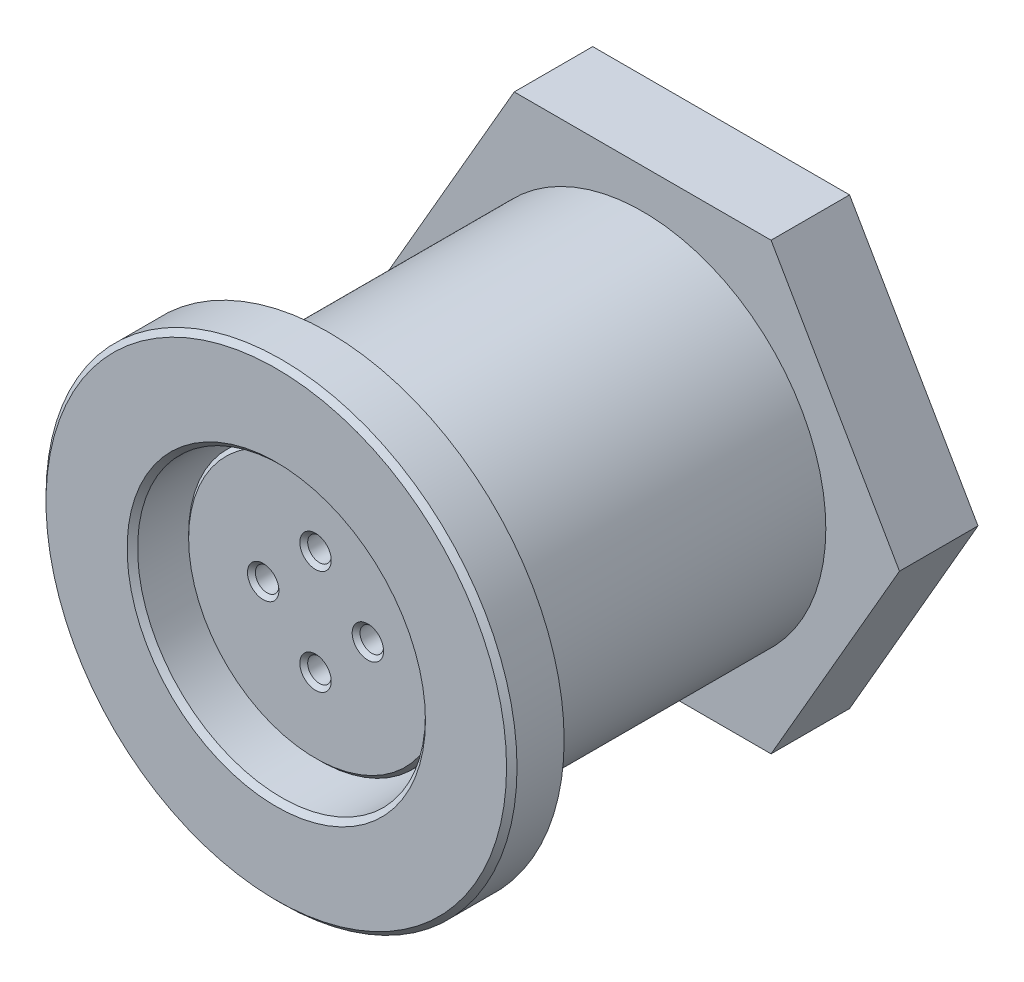
ISO-10303-21;
HEADER;
FILE_DESCRIPTION(('STEP AP214'),'2;1');
FILE_NAME('part.step','',(''),(''),'','','');
FILE_SCHEMA(('AUTOMOTIVE_DESIGN { 1 0 10303 214 1 1 1 1 }'));
ENDSEC;
DATA;
#1=APPLICATION_CONTEXT('core data for automotive mechanical design processes');
#2=APPLICATION_PROTOCOL_DEFINITION('international standard','automotive_design',2000,#1);
#3=PRODUCT_CONTEXT('',#1,'mechanical');
#4=PRODUCT('Part','Part','',(#3));
#5=PRODUCT_RELATED_PRODUCT_CATEGORY('part','',(#4));
#6=PRODUCT_DEFINITION_FORMATION('','',#4);
#7=PRODUCT_DEFINITION_CONTEXT('part definition',#1,'design');
#8=PRODUCT_DEFINITION('design','',#6,#7);
#9=PRODUCT_DEFINITION_SHAPE('','',#8);
#10=(LENGTH_UNIT() NAMED_UNIT(*) SI_UNIT(.MILLI.,.METRE.));
#11=(NAMED_UNIT(*) PLANE_ANGLE_UNIT() SI_UNIT($,.RADIAN.));
#12=(NAMED_UNIT(*) SI_UNIT($,.STERADIAN.) SOLID_ANGLE_UNIT());
#13=UNCERTAINTY_MEASURE_WITH_UNIT(LENGTH_MEASURE(1.E-05),#10,'distance_accuracy_value','');
#14=(GEOMETRIC_REPRESENTATION_CONTEXT(3) GLOBAL_UNCERTAINTY_ASSIGNED_CONTEXT((#13)) GLOBAL_UNIT_ASSIGNED_CONTEXT((#10,
#11,#12)) REPRESENTATION_CONTEXT('',''));
#15=CARTESIAN_POINT('',(0.,0.,0.));
#16=DIRECTION('',(0.,0.,1.));
#17=DIRECTION('',(1.,0.,0.));
#18=AXIS2_PLACEMENT_3D('',#15,#16,#17);
#19=CARTESIAN_POINT('',(0.,0.,-8.));
#20=DIRECTION('',(0.,0.,1.));
#21=DIRECTION('',(1.,0.,0.));
#22=AXIS2_PLACEMENT_3D('',#19,#20,#21);
#23=PLANE('',#22);
#24=CARTESIAN_POINT('',(0.,0.,-8.));
#25=DIRECTION('',(0.,0.,1.));
#26=DIRECTION('',(1.,0.,0.));
#27=AXIS2_PLACEMENT_3D('',#24,#25,#26);
#28=CIRCLE('',#27,5.5);
#29=CARTESIAN_POINT('',(5.5,0.,-8.));
#30=VERTEX_POINT('',#29);
#31=EDGE_CURVE('E169',#30,#30,#28,.T.);
#32=ORIENTED_EDGE('',*,*,#31,.T.);
#33=EDGE_LOOP('',(#32));
#34=FACE_BOUND('',#33,.T.);
#35=CARTESIAN_POINT('',(0.,0.,-8.));
#36=DIRECTION('',(0.,0.,1.));
#37=DIRECTION('',(1.,0.,0.));
#38=AXIS2_PLACEMENT_3D('',#35,#36,#37);
#39=CIRCLE('',#38,5.);
#40=CARTESIAN_POINT('',(5.,0.,-8.));
#41=VERTEX_POINT('',#40);
#42=EDGE_CURVE('E157',#41,#41,#39,.T.);
#43=ORIENTED_EDGE('',*,*,#42,.F.);
#44=EDGE_LOOP('',(#43));
#45=FACE_BOUND('',#44,.T.);
#46=ADVANCED_FACE('F32',(#34,#45),#23,.T.);
#47=CARTESIAN_POINT('',(0.,0.,0.));
#48=DIRECTION('',(0.,0.,1.));
#49=DIRECTION('',(1.,0.,0.));
#50=AXIS2_PLACEMENT_3D('',#47,#48,#49);
#51=PLANE('',#50);
#52=CARTESIAN_POINT('',(0.,0.,0.));
#53=DIRECTION('',(0.,0.,-1.));
#54=DIRECTION('',(-1.,0.,0.));
#55=AXIS2_PLACEMENT_3D('',#52,#53,#54);
#56=CIRCLE('',#55,8.25);
#57=CARTESIAN_POINT('',(-8.25,0.,0.));
#58=VERTEX_POINT('',#57);
#59=EDGE_CURVE('E163',#58,#58,#56,.T.);
#60=ORIENTED_EDGE('',*,*,#59,.F.);
#61=EDGE_LOOP('',(#60));
#62=FACE_BOUND('',#61,.T.);
#63=CARTESIAN_POINT('',(0.,0.,0.));
#64=DIRECTION('',(0.,0.,1.));
#65=DIRECTION('',(1.,0.,0.));
#66=AXIS2_PLACEMENT_3D('',#63,#64,#65);
#67=CIRCLE('',#66,9.);
#68=CARTESIAN_POINT('',(9.,0.,0.));
#69=VERTEX_POINT('',#68);
#70=EDGE_CURVE('E172',#69,#69,#67,.T.);
#71=ORIENTED_EDGE('',*,*,#70,.F.);
#72=EDGE_LOOP('',(#71));
#73=FACE_BOUND('',#72,.T.);
#74=ADVANCED_FACE('F250',(#62,#73),#51,.F.);
#75=CARTESIAN_POINT('',(0.,0.,2.));
#76=DIRECTION('',(0.,0.,-1.));
#77=DIRECTION('',(-1.,0.,0.));
#78=AXIS2_PLACEMENT_3D('',#75,#76,#77);
#79=CYLINDRICAL_SURFACE('',#78,9.);
#80=CARTESIAN_POINT('',(0.,0.,1.80000000000001));
#81=DIRECTION('',(0.,0.,1.));
#82=DIRECTION('',(1.,0.,0.));
#83=AXIS2_PLACEMENT_3D('',#80,#81,#82);
#84=CIRCLE('',#83,9.);
#85=CARTESIAN_POINT('',(9.,0.,1.80000000000001));
#86=VERTEX_POINT('',#85);
#87=EDGE_CURVE('E214',#86,#86,#84,.F.);
#88=ORIENTED_EDGE('',*,*,#87,.T.);
#89=EDGE_LOOP('',(#88));
#90=FACE_BOUND('',#89,.T.);
#91=ORIENTED_EDGE('',*,*,#70,.T.);
#92=EDGE_LOOP('',(#91));
#93=FACE_BOUND('',#92,.T.);
#94=ADVANCED_FACE('F34',(#90,#93),#79,.T.);
#95=CARTESIAN_POINT('',(0.,0.,2.));
#96=DIRECTION('',(0.,0.,1.));
#97=DIRECTION('',(1.,0.,0.));
#98=AXIS2_PLACEMENT_3D('',#95,#96,#97);
#99=PLANE('',#98);
#100=CARTESIAN_POINT('',(0.,0.,2.));
#101=DIRECTION('',(0.,0.,1.));
#102=DIRECTION('',(1.,0.,0.));
#103=AXIS2_PLACEMENT_3D('',#100,#101,#102);
#104=CIRCLE('',#103,5.7);
#105=CARTESIAN_POINT('',(5.7,0.,2.));
#106=VERTEX_POINT('',#105);
#107=EDGE_CURVE('E211',#106,#106,#104,.F.);
#108=ORIENTED_EDGE('',*,*,#107,.T.);
#109=EDGE_LOOP('',(#108));
#110=FACE_BOUND('',#109,.T.);
#111=CARTESIAN_POINT('',(0.,0.,2.));
#112=DIRECTION('',(0.,0.,1.));
#113=DIRECTION('',(1.,0.,0.));
#114=AXIS2_PLACEMENT_3D('',#111,#112,#113);
#115=CIRCLE('',#114,8.80000000000001);
#116=CARTESIAN_POINT('',(8.80000000000001,0.,2.));
#117=VERTEX_POINT('',#116);
#118=EDGE_CURVE('E208',#117,#117,#115,.T.);
#119=ORIENTED_EDGE('',*,*,#118,.T.);
#120=EDGE_LOOP('',(#119));
#121=FACE_BOUND('',#120,.T.);
#122=ADVANCED_FACE('F265',(#110,#121),#99,.T.);
#123=CARTESIAN_POINT('',(0.,0.,-8.));
#124=DIRECTION('',(0.,0.,1.));
#125=DIRECTION('',(1.,0.,0.));
#126=AXIS2_PLACEMENT_3D('',#123,#124,#125);
#127=CYLINDRICAL_SURFACE('',#126,5.5);
#128=CARTESIAN_POINT('',(0.,0.,1.8));
#129=DIRECTION('',(0.,0.,1.));
#130=DIRECTION('',(1.,0.,0.));
#131=AXIS2_PLACEMENT_3D('',#128,#129,#130);
#132=CIRCLE('',#131,5.5);
#133=CARTESIAN_POINT('',(5.5,0.,1.8));
#134=VERTEX_POINT('',#133);
#135=EDGE_CURVE('E205',#134,#134,#132,.T.);
#136=ORIENTED_EDGE('',*,*,#135,.T.);
#137=EDGE_LOOP('',(#136));
#138=FACE_BOUND('',#137,.T.);
#139=ORIENTED_EDGE('',*,*,#31,.F.);
#140=EDGE_LOOP('',(#139));
#141=FACE_BOUND('',#140,.T.);
#142=ADVANCED_FACE('F263',(#138,#141),#127,.F.);
#143=CARTESIAN_POINT('',(0.,0.,1.));
#144=DIRECTION('',(0.,0.,-1.));
#145=DIRECTION('',(-1.,0.,0.));
#146=AXIS2_PLACEMENT_3D('',#143,#144,#145);
#147=CYLINDRICAL_SURFACE('',#146,8.25);
#148=CARTESIAN_POINT('',(0.,0.,1.));
#149=DIRECTION('',(0.,0.,-1.));
#150=DIRECTION('',(-1.,0.,0.));
#151=AXIS2_PLACEMENT_3D('',#148,#149,#150);
#152=CIRCLE('',#151,8.25);
#153=CARTESIAN_POINT('',(-8.25,0.,1.));
#154=VERTEX_POINT('',#153);
#155=EDGE_CURVE('E166',#154,#154,#152,.T.);
#156=ORIENTED_EDGE('',*,*,#155,.F.);
#157=EDGE_LOOP('',(#156));
#158=FACE_BOUND('',#157,.T.);
#159=ORIENTED_EDGE('',*,*,#59,.T.);
#160=EDGE_LOOP('',(#159));
#161=FACE_BOUND('',#160,.T.);
#162=ADVANCED_FACE('F261',(#158,#161),#147,.F.);
#163=CARTESIAN_POINT('',(0.,0.,1.));
#164=DIRECTION('',(0.,0.,-1.));
#165=DIRECTION('',(-1.,0.,0.));
#166=AXIS2_PLACEMENT_3D('',#163,#164,#165);
#167=PLANE('',#166);
#168=CARTESIAN_POINT('',(0.,0.,1.));
#169=DIRECTION('',(0.,0.,-1.));
#170=DIRECTION('',(-1.,0.,0.));
#171=AXIS2_PLACEMENT_3D('',#168,#169,#170);
#172=CIRCLE('',#171,7.);
#173=CARTESIAN_POINT('',(-7.,0.,1.));
#174=VERTEX_POINT('',#173);
#175=EDGE_CURVE('E160',#174,#174,#172,.T.);
#176=ORIENTED_EDGE('',*,*,#175,.F.);
#177=EDGE_LOOP('',(#176));
#178=FACE_BOUND('',#177,.T.);
#179=ORIENTED_EDGE('',*,*,#155,.T.);
#180=EDGE_LOOP('',(#179));
#181=FACE_BOUND('',#180,.T.);
#182=ADVANCED_FACE('F271',(#178,#181),#167,.T.);
#183=CARTESIAN_POINT('',(0.,0.,-16.));
#184=DIRECTION('',(0.,0.,1.));
#185=DIRECTION('',(1.,0.,0.));
#186=AXIS2_PLACEMENT_3D('',#183,#184,#185);
#187=CYLINDRICAL_SURFACE('',#186,7.);
#188=CARTESIAN_POINT('',(0.,0.,-12.));
#189=DIRECTION('',(0.,0.,1.));
#190=DIRECTION('',(1.,0.,0.));
#191=AXIS2_PLACEMENT_3D('',#188,#189,#190);
#192=CIRCLE('',#191,7.);
#193=CARTESIAN_POINT('',(7.,0.,-12.));
#194=VERTEX_POINT('',#193);
#195=EDGE_CURVE('E36',#194,#194,#192,.T.);
#196=ORIENTED_EDGE('',*,*,#195,.T.);
#197=EDGE_LOOP('',(#196));
#198=FACE_BOUND('',#197,.T.);
#199=ORIENTED_EDGE('',*,*,#175,.T.);
#200=EDGE_LOOP('',(#199));
#201=FACE_BOUND('',#200,.T.);
#202=ADVANCED_FACE('F268',(#198,#201),#187,.T.);
#203=CARTESIAN_POINT('',(0.,0.,0.5));
#204=DIRECTION('',(0.,0.,-1.));
#205=DIRECTION('',(-1.,0.,0.));
#206=AXIS2_PLACEMENT_3D('',#203,#204,#205);
#207=CYLINDRICAL_SURFACE('',#206,5.);
#208=CARTESIAN_POINT('',(0.,0.,0.349999999999999));
#209=DIRECTION('',(0.,0.,1.));
#210=DIRECTION('',(1.,0.,0.));
#211=AXIS2_PLACEMENT_3D('',#208,#209,#210);
#212=CIRCLE('',#211,5.);
#213=CARTESIAN_POINT('',(5.,0.,0.349999999999999));
#214=VERTEX_POINT('',#213);
#215=EDGE_CURVE('E196',#214,#214,#212,.F.);
#216=ORIENTED_EDGE('',*,*,#215,.T.);
#217=EDGE_LOOP('',(#216));
#218=FACE_BOUND('',#217,.T.);
#219=ORIENTED_EDGE('',*,*,#42,.T.);
#220=EDGE_LOOP('',(#219));
#221=FACE_BOUND('',#220,.T.);
#222=ADVANCED_FACE('F270',(#218,#221),#207,.T.);
#223=CARTESIAN_POINT('',(0.,0.,0.5));
#224=DIRECTION('',(0.,0.,1.));
#225=DIRECTION('',(1.,0.,0.));
#226=AXIS2_PLACEMENT_3D('',#223,#224,#225);
#227=PLANE('',#226);
#228=CARTESIAN_POINT('',(2.,0.,0.5));
#229=DIRECTION('',(0.,0.,1.));
#230=DIRECTION('',(1.,0.,0.));
#231=AXIS2_PLACEMENT_3D('',#228,#229,#230);
#232=CIRCLE('',#231,0.599999999999996);
#233=CARTESIAN_POINT('',(2.6,0.,0.5));
#234=VERTEX_POINT('',#233);
#235=EDGE_CURVE('E190',#234,#234,#232,.F.);
#236=ORIENTED_EDGE('',*,*,#235,.T.);
#237=EDGE_LOOP('',(#236));
#238=FACE_BOUND('',#237,.T.);
#239=CARTESIAN_POINT('',(-2.,0.,0.5));
#240=DIRECTION('',(0.,0.,1.));
#241=DIRECTION('',(1.,0.,0.));
#242=AXIS2_PLACEMENT_3D('',#239,#240,#241);
#243=CIRCLE('',#242,0.599999999999996);
#244=CARTESIAN_POINT('',(-1.4,0.,0.5));
#245=VERTEX_POINT('',#244);
#246=EDGE_CURVE('E187',#245,#245,#243,.F.);
#247=ORIENTED_EDGE('',*,*,#246,.T.);
#248=EDGE_LOOP('',(#247));
#249=FACE_BOUND('',#248,.T.);
#250=CARTESIAN_POINT('',(0.,0.,0.5));
#251=DIRECTION('',(0.,0.,1.));
#252=DIRECTION('',(1.,0.,0.));
#253=AXIS2_PLACEMENT_3D('',#250,#251,#252);
#254=CIRCLE('',#253,4.85);
#255=CARTESIAN_POINT('',(4.85,0.,0.5));
#256=VERTEX_POINT('',#255);
#257=EDGE_CURVE('E184',#256,#256,#254,.T.);
#258=ORIENTED_EDGE('',*,*,#257,.T.);
#259=EDGE_LOOP('',(#258));
#260=FACE_BOUND('',#259,.T.);
#261=CARTESIAN_POINT('',(0.,-2.,0.5));
#262=DIRECTION('',(0.,0.,1.));
#263=DIRECTION('',(1.,0.,0.));
#264=AXIS2_PLACEMENT_3D('',#261,#262,#263);
#265=CIRCLE('',#264,0.599999999999996);
#266=CARTESIAN_POINT('',(0.599999999999996,-2.,0.5));
#267=VERTEX_POINT('',#266);
#268=EDGE_CURVE('E181',#267,#267,#265,.F.);
#269=ORIENTED_EDGE('',*,*,#268,.T.);
#270=EDGE_LOOP('',(#269));
#271=FACE_BOUND('',#270,.T.);
#272=CARTESIAN_POINT('',(0.,2.,0.5));
#273=DIRECTION('',(0.,0.,1.));
#274=DIRECTION('',(1.,0.,0.));
#275=AXIS2_PLACEMENT_3D('',#272,#273,#274);
#276=CIRCLE('',#275,0.599999999999996);
#277=CARTESIAN_POINT('',(0.599999999999996,2.,0.5));
#278=VERTEX_POINT('',#277);
#279=EDGE_CURVE('E178',#278,#278,#276,.F.);
#280=ORIENTED_EDGE('',*,*,#279,.T.);
#281=EDGE_LOOP('',(#280));
#282=FACE_BOUND('',#281,.T.);
#283=ADVANCED_FACE('F349',(#238,#249,#260,#271,#282),#227,.T.);
#284=CARTESIAN_POINT('',(0.,2.,-6.5));
#285=DIRECTION('',(0.,0.,1.));
#286=DIRECTION('',(1.,0.,0.));
#287=AXIS2_PLACEMENT_3D('',#284,#285,#286);
#288=CYLINDRICAL_SURFACE('',#287,0.45);
#289=CARTESIAN_POINT('',(0.,2.,0.350000000000006));
#290=DIRECTION('',(0.,0.,1.));
#291=DIRECTION('',(1.,0.,0.));
#292=AXIS2_PLACEMENT_3D('',#289,#290,#291);
#293=CIRCLE('',#292,0.45);
#294=CARTESIAN_POINT('',(0.45,2.,0.350000000000006));
#295=VERTEX_POINT('',#294);
#296=EDGE_CURVE('E202',#295,#295,#293,.T.);
#297=ORIENTED_EDGE('',*,*,#296,.T.);
#298=EDGE_LOOP('',(#297));
#299=FACE_BOUND('',#298,.T.);
#300=CARTESIAN_POINT('',(0.,2.,-6.5));
#301=DIRECTION('',(0.,0.,1.));
#302=DIRECTION('',(1.,0.,0.));
#303=AXIS2_PLACEMENT_3D('',#300,#301,#302);
#304=CIRCLE('',#303,0.45);
#305=CARTESIAN_POINT('',(0.45,2.,-6.5));
#306=VERTEX_POINT('',#305);
#307=EDGE_CURVE('E154',#306,#306,#304,.T.);
#308=ORIENTED_EDGE('',*,*,#307,.F.);
#309=EDGE_LOOP('',(#308));
#310=FACE_BOUND('',#309,.T.);
#311=ADVANCED_FACE('F345',(#299,#310),#288,.F.);
#312=CARTESIAN_POINT('',(0.,2.,-6.5));
#313=DIRECTION('',(0.,0.,1.));
#314=DIRECTION('',(1.,0.,0.));
#315=AXIS2_PLACEMENT_3D('',#312,#313,#314);
#316=PLANE('',#315);
#317=ORIENTED_EDGE('',*,*,#307,.T.);
#318=EDGE_LOOP('',(#317));
#319=FACE_BOUND('',#318,.T.);
#320=ADVANCED_FACE('F341',(#319),#316,.T.);
#321=CARTESIAN_POINT('',(0.,-2.,-6.5));
#322=DIRECTION('',(0.,0.,1.));
#323=DIRECTION('',(1.,0.,0.));
#324=AXIS2_PLACEMENT_3D('',#321,#322,#323);
#325=CYLINDRICAL_SURFACE('',#324,0.45);
#326=CARTESIAN_POINT('',(0.,-2.,0.350000000000006));
#327=DIRECTION('',(0.,0.,1.));
#328=DIRECTION('',(1.,0.,0.));
#329=AXIS2_PLACEMENT_3D('',#326,#327,#328);
#330=CIRCLE('',#329,0.45);
#331=CARTESIAN_POINT('',(0.45,-2.,0.350000000000006));
#332=VERTEX_POINT('',#331);
#333=EDGE_CURVE('E199',#332,#332,#330,.T.);
#334=ORIENTED_EDGE('',*,*,#333,.T.);
#335=EDGE_LOOP('',(#334));
#336=FACE_BOUND('',#335,.T.);
#337=CARTESIAN_POINT('',(0.,-2.,-6.5));
#338=DIRECTION('',(0.,0.,1.));
#339=DIRECTION('',(1.,0.,0.));
#340=AXIS2_PLACEMENT_3D('',#337,#338,#339);
#341=CIRCLE('',#340,0.45);
#342=CARTESIAN_POINT('',(0.45,-2.,-6.5));
#343=VERTEX_POINT('',#342);
#344=EDGE_CURVE('E151',#343,#343,#341,.T.);
#345=ORIENTED_EDGE('',*,*,#344,.F.);
#346=EDGE_LOOP('',(#345));
#347=FACE_BOUND('',#346,.T.);
#348=ADVANCED_FACE('F337',(#336,#347),#325,.F.);
#349=CARTESIAN_POINT('',(0.,-2.,-6.5));
#350=DIRECTION('',(0.,0.,1.));
#351=DIRECTION('',(1.,0.,0.));
#352=AXIS2_PLACEMENT_3D('',#349,#350,#351);
#353=PLANE('',#352);
#354=ORIENTED_EDGE('',*,*,#344,.T.);
#355=EDGE_LOOP('',(#354));
#356=FACE_BOUND('',#355,.T.);
#357=ADVANCED_FACE('F333',(#356),#353,.T.);
#358=CARTESIAN_POINT('',(2.,0.,-6.5));
#359=DIRECTION('',(0.,0.,1.));
#360=DIRECTION('',(1.,0.,0.));
#361=AXIS2_PLACEMENT_3D('',#358,#359,#360);
#362=CYLINDRICAL_SURFACE('',#361,0.45);
#363=CARTESIAN_POINT('',(2.,0.,0.350000000000006));
#364=DIRECTION('',(0.,0.,1.));
#365=DIRECTION('',(1.,0.,0.));
#366=AXIS2_PLACEMENT_3D('',#363,#364,#365);
#367=CIRCLE('',#366,0.45);
#368=CARTESIAN_POINT('',(2.45,0.,0.350000000000006));
#369=VERTEX_POINT('',#368);
#370=EDGE_CURVE('E175',#369,#369,#367,.T.);
#371=ORIENTED_EDGE('',*,*,#370,.T.);
#372=EDGE_LOOP('',(#371));
#373=FACE_BOUND('',#372,.T.);
#374=CARTESIAN_POINT('',(2.,0.,-6.5));
#375=DIRECTION('',(0.,0.,1.));
#376=DIRECTION('',(1.,0.,0.));
#377=AXIS2_PLACEMENT_3D('',#374,#375,#376);
#378=CIRCLE('',#377,0.45);
#379=CARTESIAN_POINT('',(2.45,0.,-6.5));
#380=VERTEX_POINT('',#379);
#381=EDGE_CURVE('E148',#380,#380,#378,.T.);
#382=ORIENTED_EDGE('',*,*,#381,.F.);
#383=EDGE_LOOP('',(#382));
#384=FACE_BOUND('',#383,.T.);
#385=ADVANCED_FACE('F329',(#373,#384),#362,.F.);
#386=CARTESIAN_POINT('',(2.,0.,-6.5));
#387=DIRECTION('',(0.,0.,1.));
#388=DIRECTION('',(1.,0.,0.));
#389=AXIS2_PLACEMENT_3D('',#386,#387,#388);
#390=PLANE('',#389);
#391=ORIENTED_EDGE('',*,*,#381,.T.);
#392=EDGE_LOOP('',(#391));
#393=FACE_BOUND('',#392,.T.);
#394=ADVANCED_FACE('F325',(#393),#390,.T.);
#395=CARTESIAN_POINT('',(-2.,0.,-6.5));
#396=DIRECTION('',(0.,0.,1.));
#397=DIRECTION('',(1.,0.,0.));
#398=AXIS2_PLACEMENT_3D('',#395,#396,#397);
#399=CYLINDRICAL_SURFACE('',#398,0.45);
#400=CARTESIAN_POINT('',(-2.,0.,0.350000000000006));
#401=DIRECTION('',(0.,0.,1.));
#402=DIRECTION('',(1.,0.,0.));
#403=AXIS2_PLACEMENT_3D('',#400,#401,#402);
#404=CIRCLE('',#403,0.45);
#405=CARTESIAN_POINT('',(-1.55,0.,0.350000000000006));
#406=VERTEX_POINT('',#405);
#407=EDGE_CURVE('E193',#406,#406,#404,.T.);
#408=ORIENTED_EDGE('',*,*,#407,.T.);
#409=EDGE_LOOP('',(#408));
#410=FACE_BOUND('',#409,.T.);
#411=CARTESIAN_POINT('',(-2.,0.,-6.5));
#412=DIRECTION('',(0.,0.,1.));
#413=DIRECTION('',(1.,0.,0.));
#414=AXIS2_PLACEMENT_3D('',#411,#412,#413);
#415=CIRCLE('',#414,0.45);
#416=CARTESIAN_POINT('',(-1.55,0.,-6.5));
#417=VERTEX_POINT('',#416);
#418=EDGE_CURVE('E145',#417,#417,#415,.T.);
#419=ORIENTED_EDGE('',*,*,#418,.F.);
#420=EDGE_LOOP('',(#419));
#421=FACE_BOUND('',#420,.T.);
#422=ADVANCED_FACE('F321',(#410,#421),#399,.F.);
#423=CARTESIAN_POINT('',(-2.,0.,-6.5));
#424=DIRECTION('',(0.,0.,1.));
#425=DIRECTION('',(1.,0.,0.));
#426=AXIS2_PLACEMENT_3D('',#423,#424,#425);
#427=PLANE('',#426);
#428=ORIENTED_EDGE('',*,*,#418,.T.);
#429=EDGE_LOOP('',(#428));
#430=FACE_BOUND('',#429,.T.);
#431=ADVANCED_FACE('F317',(#430),#427,.T.);
#432=CARTESIAN_POINT('',(2.,0.,0.350000000000006));
#433=DIRECTION('',(0.,0.,1.));
#434=DIRECTION('',(1.,0.,0.));
#435=AXIS2_PLACEMENT_3D('',#432,#433,#434);
#436=CONICAL_SURFACE('',#435,0.45,0.785398163397455);
#437=ORIENTED_EDGE('',*,*,#235,.F.);
#438=EDGE_LOOP('',(#437));
#439=FACE_BOUND('',#438,.T.);
#440=ORIENTED_EDGE('',*,*,#370,.F.);
#441=EDGE_LOOP('',(#440));
#442=FACE_BOUND('',#441,.T.);
#443=ADVANCED_FACE('F313',(#439,#442),#436,.F.);
#444=CARTESIAN_POINT('',(-2.,0.,0.350000000000006));
#445=DIRECTION('',(0.,0.,1.));
#446=DIRECTION('',(1.,0.,0.));
#447=AXIS2_PLACEMENT_3D('',#444,#445,#446);
#448=CONICAL_SURFACE('',#447,0.45,0.785398163397453);
#449=ORIENTED_EDGE('',*,*,#246,.F.);
#450=EDGE_LOOP('',(#449));
#451=FACE_BOUND('',#450,.T.);
#452=ORIENTED_EDGE('',*,*,#407,.F.);
#453=EDGE_LOOP('',(#452));
#454=FACE_BOUND('',#453,.T.);
#455=ADVANCED_FACE('F309',(#451,#454),#448,.F.);
#456=CARTESIAN_POINT('',(0.,0.,0.5));
#457=DIRECTION('',(0.,0.,-1.));
#458=DIRECTION('',(-1.,0.,0.));
#459=AXIS2_PLACEMENT_3D('',#456,#457,#458);
#460=CONICAL_SURFACE('',#459,4.85,0.785398163397443);
#461=ORIENTED_EDGE('',*,*,#215,.F.);
#462=EDGE_LOOP('',(#461));
#463=FACE_BOUND('',#462,.T.);
#464=ORIENTED_EDGE('',*,*,#257,.F.);
#465=EDGE_LOOP('',(#464));
#466=FACE_BOUND('',#465,.T.);
#467=ADVANCED_FACE('F305',(#463,#466),#460,.T.);
#468=CARTESIAN_POINT('',(0.,-2.,0.350000000000006));
#469=DIRECTION('',(0.,0.,1.));
#470=DIRECTION('',(1.,0.,0.));
#471=AXIS2_PLACEMENT_3D('',#468,#469,#470);
#472=CONICAL_SURFACE('',#471,0.45,0.785398163397454);
#473=ORIENTED_EDGE('',*,*,#268,.F.);
#474=EDGE_LOOP('',(#473));
#475=FACE_BOUND('',#474,.T.);
#476=ORIENTED_EDGE('',*,*,#333,.F.);
#477=EDGE_LOOP('',(#476));
#478=FACE_BOUND('',#477,.T.);
#479=ADVANCED_FACE('F301',(#475,#478),#472,.F.);
#480=CARTESIAN_POINT('',(0.,2.,0.350000000000006));
#481=DIRECTION('',(0.,0.,1.));
#482=DIRECTION('',(1.,0.,0.));
#483=AXIS2_PLACEMENT_3D('',#480,#481,#482);
#484=CONICAL_SURFACE('',#483,0.45,0.785398163397454);
#485=ORIENTED_EDGE('',*,*,#279,.F.);
#486=EDGE_LOOP('',(#485));
#487=FACE_BOUND('',#486,.T.);
#488=ORIENTED_EDGE('',*,*,#296,.F.);
#489=EDGE_LOOP('',(#488));
#490=FACE_BOUND('',#489,.T.);
#491=ADVANCED_FACE('F294',(#487,#490),#484,.F.);
#492=CARTESIAN_POINT('',(0.,0.,1.8));
#493=DIRECTION('',(0.,0.,1.));
#494=DIRECTION('',(1.,0.,0.));
#495=AXIS2_PLACEMENT_3D('',#492,#493,#494);
#496=CONICAL_SURFACE('',#495,5.5,0.785398163397457);
#497=ORIENTED_EDGE('',*,*,#107,.F.);
#498=EDGE_LOOP('',(#497));
#499=FACE_BOUND('',#498,.T.);
#500=ORIENTED_EDGE('',*,*,#135,.F.);
#501=EDGE_LOOP('',(#500));
#502=FACE_BOUND('',#501,.T.);
#503=ADVANCED_FACE('F286',(#499,#502),#496,.F.);
#504=CARTESIAN_POINT('',(0.,0.,2.));
#505=DIRECTION('',(0.,0.,-1.));
#506=DIRECTION('',(-1.,0.,0.));
#507=AXIS2_PLACEMENT_3D('',#504,#505,#506);
#508=CONICAL_SURFACE('',#507,8.80000000000001,0.785398163397444);
#509=ORIENTED_EDGE('',*,*,#87,.F.);
#510=EDGE_LOOP('',(#509));
#511=FACE_BOUND('',#510,.T.);
#512=ORIENTED_EDGE('',*,*,#118,.F.);
#513=EDGE_LOOP('',(#512));
#514=FACE_BOUND('',#513,.T.);
#515=ADVANCED_FACE('F283',(#511,#514),#508,.T.);
#516=CARTESIAN_POINT('',(4.90747728811182,8.5,-12.));
#517=DIRECTION('',(0.,0.,1.));
#518=DIRECTION('',(1.,0.,0.));
#519=AXIS2_PLACEMENT_3D('',#516,#517,#518);
#520=PLANE('',#519);
#521=DIRECTION('',(0.5,-0.866025403784439,0.));
#522=VECTOR('',#521,1.);
#523=CARTESIAN_POINT('',(9.81495457622364,0.,-12.));
#524=LINE('',#523,#522);
#525=CARTESIAN_POINT('',(4.90747728811182,8.5,-12.));
#526=VERTEX_POINT('',#525);
#527=CARTESIAN_POINT('',(9.81495457622364,0.,-12.));
#528=VERTEX_POINT('',#527);
#529=EDGE_CURVE('E92',#526,#528,#524,.T.);
#530=ORIENTED_EDGE('',*,*,#529,.F.);
#531=DIRECTION('',(1.,0.,0.));
#532=VECTOR('',#531,1.);
#533=CARTESIAN_POINT('',(4.90747728811182,8.5,-12.));
#534=LINE('',#533,#532);
#535=CARTESIAN_POINT('',(-4.90747728811182,8.5,-12.));
#536=VERTEX_POINT('',#535);
#537=EDGE_CURVE('E97',#536,#526,#534,.T.);
#538=ORIENTED_EDGE('',*,*,#537,.F.);
#539=DIRECTION('',(0.5,0.866025403784439,0.));
#540=VECTOR('',#539,1.);
#541=CARTESIAN_POINT('',(-4.90747728811182,8.5,-12.));
#542=LINE('',#541,#540);
#543=CARTESIAN_POINT('',(-9.81495457622364,0.,-12.));
#544=VERTEX_POINT('',#543);
#545=EDGE_CURVE('E129',#544,#536,#542,.T.);
#546=ORIENTED_EDGE('',*,*,#545,.F.);
#547=DIRECTION('',(-0.5,0.866025403784439,0.));
#548=VECTOR('',#547,1.);
#549=CARTESIAN_POINT('',(-9.81495457622364,0.,-12.));
#550=LINE('',#549,#548);
#551=CARTESIAN_POINT('',(-4.90747728811182,-8.5,-12.));
#552=VERTEX_POINT('',#551);
#553=EDGE_CURVE('E126',#552,#544,#550,.T.);
#554=ORIENTED_EDGE('',*,*,#553,.F.);
#555=DIRECTION('',(-1.,0.,0.));
#556=VECTOR('',#555,1.);
#557=CARTESIAN_POINT('',(-4.90747728811182,-8.5,-12.));
#558=LINE('',#557,#556);
#559=CARTESIAN_POINT('',(4.90747728811182,-8.5,-12.));
#560=VERTEX_POINT('',#559);
#561=EDGE_CURVE('E123',#560,#552,#558,.T.);
#562=ORIENTED_EDGE('',*,*,#561,.F.);
#563=DIRECTION('',(-0.5,-0.866025403784439,0.));
#564=VECTOR('',#563,1.);
#565=CARTESIAN_POINT('',(4.90747728811182,-8.5,-12.));
#566=LINE('',#565,#564);
#567=EDGE_CURVE('E121',#528,#560,#566,.T.);
#568=ORIENTED_EDGE('',*,*,#567,.F.);
#569=EDGE_LOOP('',(#530,#538,#546,#554,#562,#568));
#570=FACE_BOUND('',#569,.T.);
#571=ORIENTED_EDGE('',*,*,#195,.F.);
#572=EDGE_LOOP('',(#571));
#573=FACE_BOUND('',#572,.T.);
#574=ADVANCED_FACE('F285',(#570,#573),#520,.T.);
#575=CARTESIAN_POINT('',(4.90747728811182,8.5,-15.));
#576=DIRECTION('',(0.,0.,1.));
#577=DIRECTION('',(1.,0.,0.));
#578=AXIS2_PLACEMENT_3D('',#575,#576,#577);
#579=PLANE('',#578);
#580=DIRECTION('',(0.5,-0.866025403784439,0.));
#581=VECTOR('',#580,1.);
#582=CARTESIAN_POINT('',(9.81495457622364,0.,-15.));
#583=LINE('',#582,#581);
#584=CARTESIAN_POINT('',(4.90747728811182,8.5,-15.));
#585=VERTEX_POINT('',#584);
#586=CARTESIAN_POINT('',(9.81495457622364,0.,-15.));
#587=VERTEX_POINT('',#586);
#588=EDGE_CURVE('E90',#585,#587,#583,.T.);
#589=ORIENTED_EDGE('',*,*,#588,.T.);
#590=DIRECTION('',(-0.5,-0.866025403784439,0.));
#591=VECTOR('',#590,1.);
#592=CARTESIAN_POINT('',(4.90747728811182,-8.5,-15.));
#593=LINE('',#592,#591);
#594=CARTESIAN_POINT('',(4.90747728811182,-8.5,-15.));
#595=VERTEX_POINT('',#594);
#596=EDGE_CURVE('E100',#587,#595,#593,.T.);
#597=ORIENTED_EDGE('',*,*,#596,.T.);
#598=DIRECTION('',(-1.,0.,0.));
#599=VECTOR('',#598,1.);
#600=CARTESIAN_POINT('',(-4.90747728811182,-8.5,-15.));
#601=LINE('',#600,#599);
#602=CARTESIAN_POINT('',(-4.90747728811182,-8.5,-15.));
#603=VERTEX_POINT('',#602);
#604=EDGE_CURVE('E105',#595,#603,#601,.T.);
#605=ORIENTED_EDGE('',*,*,#604,.T.);
#606=DIRECTION('',(-0.5,0.866025403784439,0.));
#607=VECTOR('',#606,1.);
#608=CARTESIAN_POINT('',(-9.81495457622364,0.,-15.));
#609=LINE('',#608,#607);
#610=CARTESIAN_POINT('',(-9.81495457622364,0.,-15.));
#611=VERTEX_POINT('',#610);
#612=EDGE_CURVE('E114',#603,#611,#609,.T.);
#613=ORIENTED_EDGE('',*,*,#612,.T.);
#614=DIRECTION('',(0.5,0.866025403784439,0.));
#615=VECTOR('',#614,1.);
#616=CARTESIAN_POINT('',(-4.90747728811182,8.5,-15.));
#617=LINE('',#616,#615);
#618=CARTESIAN_POINT('',(-4.90747728811182,8.5,-15.));
#619=VERTEX_POINT('',#618);
#620=EDGE_CURVE('E117',#611,#619,#617,.T.);
#621=ORIENTED_EDGE('',*,*,#620,.T.);
#622=DIRECTION('',(1.,0.,0.));
#623=VECTOR('',#622,1.);
#624=CARTESIAN_POINT('',(4.90747728811182,8.5,-15.));
#625=LINE('',#624,#623);
#626=EDGE_CURVE('E110',#619,#585,#625,.T.);
#627=ORIENTED_EDGE('',*,*,#626,.T.);
#628=EDGE_LOOP('',(#589,#597,#605,#613,#621,#627));
#629=FACE_BOUND('',#628,.T.);
#630=CARTESIAN_POINT('',(0.,0.,-15.));
#631=DIRECTION('',(0.,0.,1.));
#632=DIRECTION('',(1.,0.,0.));
#633=AXIS2_PLACEMENT_3D('',#630,#631,#632);
#634=CIRCLE('',#633,7.);
#635=CARTESIAN_POINT('',(7.,0.,-15.));
#636=VERTEX_POINT('',#635);
#637=EDGE_CURVE('E11',#636,#636,#634,.T.);
#638=ORIENTED_EDGE('',*,*,#637,.T.);
#639=EDGE_LOOP('',(#638));
#640=FACE_BOUND('',#639,.T.);
#641=ADVANCED_FACE('F107',(#629,#640),#579,.F.);
#642=CARTESIAN_POINT('',(9.81495457622364,0.,-12.));
#643=DIRECTION('',(0.866025403784439,0.5,0.));
#644=DIRECTION('',(-0.5,0.866025403784439,0.));
#645=AXIS2_PLACEMENT_3D('',#642,#643,#644);
#646=PLANE('',#645);
#647=ORIENTED_EDGE('',*,*,#588,.F.);
#648=DIRECTION('',(0.,0.,-1.));
#649=VECTOR('',#648,1.);
#650=CARTESIAN_POINT('',(4.90747728811182,8.5,-12.));
#651=LINE('',#650,#649);
#652=EDGE_CURVE('E49',#526,#585,#651,.T.);
#653=ORIENTED_EDGE('',*,*,#652,.F.);
#654=ORIENTED_EDGE('',*,*,#529,.T.);
#655=DIRECTION('',(0.,0.,-1.));
#656=VECTOR('',#655,1.);
#657=CARTESIAN_POINT('',(9.81495457622364,0.,-12.));
#658=LINE('',#657,#656);
#659=EDGE_CURVE('E86',#528,#587,#658,.T.);
#660=ORIENTED_EDGE('',*,*,#659,.T.);
#661=EDGE_LOOP('',(#647,#653,#654,#660));
#662=FACE_BOUND('',#661,.T.);
#663=ADVANCED_FACE('F88',(#662),#646,.T.);
#664=CARTESIAN_POINT('',(4.90747728811182,8.5,-12.));
#665=DIRECTION('',(0.,1.,0.));
#666=DIRECTION('',(0.,0.,1.));
#667=AXIS2_PLACEMENT_3D('',#664,#665,#666);
#668=PLANE('',#667);
#669=ORIENTED_EDGE('',*,*,#626,.F.);
#670=DIRECTION('',(0.,0.,-1.));
#671=VECTOR('',#670,1.);
#672=CARTESIAN_POINT('',(-4.90747728811182,8.5,-12.));
#673=LINE('',#672,#671);
#674=EDGE_CURVE('E57',#536,#619,#673,.T.);
#675=ORIENTED_EDGE('',*,*,#674,.F.);
#676=ORIENTED_EDGE('',*,*,#537,.T.);
#677=ORIENTED_EDGE('',*,*,#652,.T.);
#678=EDGE_LOOP('',(#669,#675,#676,#677));
#679=FACE_BOUND('',#678,.T.);
#680=ADVANCED_FACE('F450',(#679),#668,.T.);
#681=CARTESIAN_POINT('',(-4.90747728811182,8.5,-12.));
#682=DIRECTION('',(-0.866025403784439,0.5,0.));
#683=DIRECTION('',(-0.5,-0.866025403784439,0.));
#684=AXIS2_PLACEMENT_3D('',#681,#682,#683);
#685=PLANE('',#684);
#686=ORIENTED_EDGE('',*,*,#620,.F.);
#687=DIRECTION('',(0.,0.,-1.));
#688=VECTOR('',#687,1.);
#689=CARTESIAN_POINT('',(-9.81495457622364,0.,-12.));
#690=LINE('',#689,#688);
#691=EDGE_CURVE('E134',#544,#611,#690,.T.);
#692=ORIENTED_EDGE('',*,*,#691,.F.);
#693=ORIENTED_EDGE('',*,*,#545,.T.);
#694=ORIENTED_EDGE('',*,*,#674,.T.);
#695=EDGE_LOOP('',(#686,#692,#693,#694));
#696=FACE_BOUND('',#695,.T.);
#697=ADVANCED_FACE('F459',(#696),#685,.T.);
#698=CARTESIAN_POINT('',(-9.81495457622364,0.,-12.));
#699=DIRECTION('',(-0.866025403784439,-0.5,0.));
#700=DIRECTION('',(0.5,-0.866025403784439,0.));
#701=AXIS2_PLACEMENT_3D('',#698,#699,#700);
#702=PLANE('',#701);
#703=ORIENTED_EDGE('',*,*,#612,.F.);
#704=DIRECTION('',(0.,0.,-1.));
#705=VECTOR('',#704,1.);
#706=CARTESIAN_POINT('',(-4.90747728811182,-8.5,-12.));
#707=LINE('',#706,#705);
#708=EDGE_CURVE('E136',#552,#603,#707,.T.);
#709=ORIENTED_EDGE('',*,*,#708,.F.);
#710=ORIENTED_EDGE('',*,*,#553,.T.);
#711=ORIENTED_EDGE('',*,*,#691,.T.);
#712=EDGE_LOOP('',(#703,#709,#710,#711));
#713=FACE_BOUND('',#712,.T.);
#714=ADVANCED_FACE('F468',(#713),#702,.T.);
#715=CARTESIAN_POINT('',(-4.90747728811182,-8.5,-12.));
#716=DIRECTION('',(0.,-1.,0.));
#717=DIRECTION('',(0.,0.,-1.));
#718=AXIS2_PLACEMENT_3D('',#715,#716,#717);
#719=PLANE('',#718);
#720=ORIENTED_EDGE('',*,*,#604,.F.);
#721=DIRECTION('',(0.,0.,-1.));
#722=VECTOR('',#721,1.);
#723=CARTESIAN_POINT('',(4.90747728811182,-8.5,-12.));
#724=LINE('',#723,#722);
#725=EDGE_CURVE('E96',#560,#595,#724,.T.);
#726=ORIENTED_EDGE('',*,*,#725,.F.);
#727=ORIENTED_EDGE('',*,*,#561,.T.);
#728=ORIENTED_EDGE('',*,*,#708,.T.);
#729=EDGE_LOOP('',(#720,#726,#727,#728));
#730=FACE_BOUND('',#729,.T.);
#731=ADVANCED_FACE('F478',(#730),#719,.T.);
#732=CARTESIAN_POINT('',(4.90747728811182,-8.5,-12.));
#733=DIRECTION('',(0.866025403784438,-0.5,0.));
#734=DIRECTION('',(0.5,0.866025403784439,0.));
#735=AXIS2_PLACEMENT_3D('',#732,#733,#734);
#736=PLANE('',#735);
#737=ORIENTED_EDGE('',*,*,#596,.F.);
#738=ORIENTED_EDGE('',*,*,#659,.F.);
#739=ORIENTED_EDGE('',*,*,#567,.T.);
#740=ORIENTED_EDGE('',*,*,#725,.T.);
#741=EDGE_LOOP('',(#737,#738,#739,#740));
#742=FACE_BOUND('',#741,.T.);
#743=ADVANCED_FACE('F101',(#742),#736,.T.);
#744=CARTESIAN_POINT('',(0.,0.,-15.));
#745=DIRECTION('',(0.,0.,-1.));
#746=DIRECTION('',(-1.,0.,0.));
#747=AXIS2_PLACEMENT_3D('',#744,#745,#746);
#748=PLANE('',#747);
#749=CARTESIAN_POINT('',(0.,0.,-15.));
#750=DIRECTION('',(0.,0.,-1.));
#751=DIRECTION('',(-1.,0.,0.));
#752=AXIS2_PLACEMENT_3D('',#749,#750,#751);
#753=CIRCLE('',#752,5.5);
#754=CARTESIAN_POINT('',(-5.5,0.,-15.));
#755=VERTEX_POINT('',#754);
#756=EDGE_CURVE('E142',#755,#755,#753,.T.);
#757=ORIENTED_EDGE('',*,*,#756,.T.);
#758=EDGE_LOOP('',(#757));
#759=FACE_BOUND('',#758,.T.);
#760=ADVANCED_FACE('F239',(#759),#748,.T.);
#761=CARTESIAN_POINT('',(0.,0.,-15.));
#762=DIRECTION('',(0.,0.,-1.));
#763=DIRECTION('',(-1.,0.,0.));
#764=AXIS2_PLACEMENT_3D('',#761,#762,#763);
#765=CYLINDRICAL_SURFACE('',#764,5.5);
#766=ORIENTED_EDGE('',*,*,#756,.F.);
#767=EDGE_LOOP('',(#766));
#768=FACE_BOUND('',#767,.T.);
#769=CARTESIAN_POINT('',(0.,0.,-16.));
#770=DIRECTION('',(0.,0.,-1.));
#771=DIRECTION('',(-1.,0.,0.));
#772=AXIS2_PLACEMENT_3D('',#769,#770,#771);
#773=CIRCLE('',#772,5.5);
#774=CARTESIAN_POINT('',(-5.5,0.,-16.));
#775=VERTEX_POINT('',#774);
#776=EDGE_CURVE('E139',#775,#775,#773,.T.);
#777=ORIENTED_EDGE('',*,*,#776,.T.);
#778=EDGE_LOOP('',(#777));
#779=FACE_BOUND('',#778,.T.);
#780=ADVANCED_FACE('F234',(#768,#779),#765,.F.);
#781=CARTESIAN_POINT('',(0.,0.,-16.));
#782=DIRECTION('',(0.,0.,-1.));
#783=DIRECTION('',(-1.,0.,0.));
#784=AXIS2_PLACEMENT_3D('',#781,#782,#783);
#785=PLANE('',#784);
#786=CARTESIAN_POINT('',(0.,0.,-16.));
#787=DIRECTION('',(0.,0.,-1.));
#788=DIRECTION('',(-1.,0.,0.));
#789=AXIS2_PLACEMENT_3D('',#786,#787,#788);
#790=CIRCLE('',#789,6.5);
#791=CARTESIAN_POINT('',(-6.5,0.,-16.));
#792=VERTEX_POINT('',#791);
#793=EDGE_CURVE('E217',#792,#792,#790,.T.);
#794=ORIENTED_EDGE('',*,*,#793,.T.);
#795=EDGE_LOOP('',(#794));
#796=FACE_BOUND('',#795,.T.);
#797=ORIENTED_EDGE('',*,*,#776,.F.);
#798=EDGE_LOOP('',(#797));
#799=FACE_BOUND('',#798,.T.);
#800=ADVANCED_FACE('F228',(#796,#799),#785,.T.);
#801=CARTESIAN_POINT('',(0.,0.,-16.));
#802=DIRECTION('',(0.,0.,1.));
#803=DIRECTION('',(1.,0.,0.));
#804=AXIS2_PLACEMENT_3D('',#801,#802,#803);
#805=CONICAL_SURFACE('',#804,6.5,0.785398163397442);
#806=CARTESIAN_POINT('',(0.,0.,-15.5));
#807=DIRECTION('',(0.,0.,-1.));
#808=DIRECTION('',(-1.,0.,0.));
#809=AXIS2_PLACEMENT_3D('',#806,#807,#808);
#810=CIRCLE('',#809,7.);
#811=CARTESIAN_POINT('',(-7.,0.,-15.5));
#812=VERTEX_POINT('',#811);
#813=EDGE_CURVE('E41',#812,#812,#810,.F.);
#814=ORIENTED_EDGE('',*,*,#813,.F.);
#815=EDGE_LOOP('',(#814));
#816=FACE_BOUND('',#815,.T.);
#817=ORIENTED_EDGE('',*,*,#793,.F.);
#818=EDGE_LOOP('',(#817));
#819=FACE_BOUND('',#818,.T.);
#820=ADVANCED_FACE('F225',(#816,#819),#805,.T.);
#821=ORIENTED_EDGE('',*,*,#813,.T.);
#822=EDGE_LOOP('',(#821));
#823=FACE_BOUND('',#822,.T.);
#824=ORIENTED_EDGE('',*,*,#637,.F.);
#825=EDGE_LOOP('',(#824));
#826=FACE_BOUND('',#825,.T.);
#827=ADVANCED_FACE('F222',(#823,#826),#187,.T.);
#828=CLOSED_SHELL('',(#46,#74,#94,#122,#142,#162,#182,#202,#222,#283,#311,#320,#348,#357,#385,
#394,#422,#431,#443,#455,#467,#479,#491,#503,#515,#574,#641,#663,#680,#697,#714,#731,#743,#760,
#780,#800,#820,#827));
#829=MANIFOLD_SOLID_BREP('B2',#828);
#830=ADVANCED_BREP_SHAPE_REPRESENTATION('',(#18,#829),#14);
#831=SHAPE_DEFINITION_REPRESENTATION(#9,#830);
ENDSEC;
END-ISO-10303-21;
